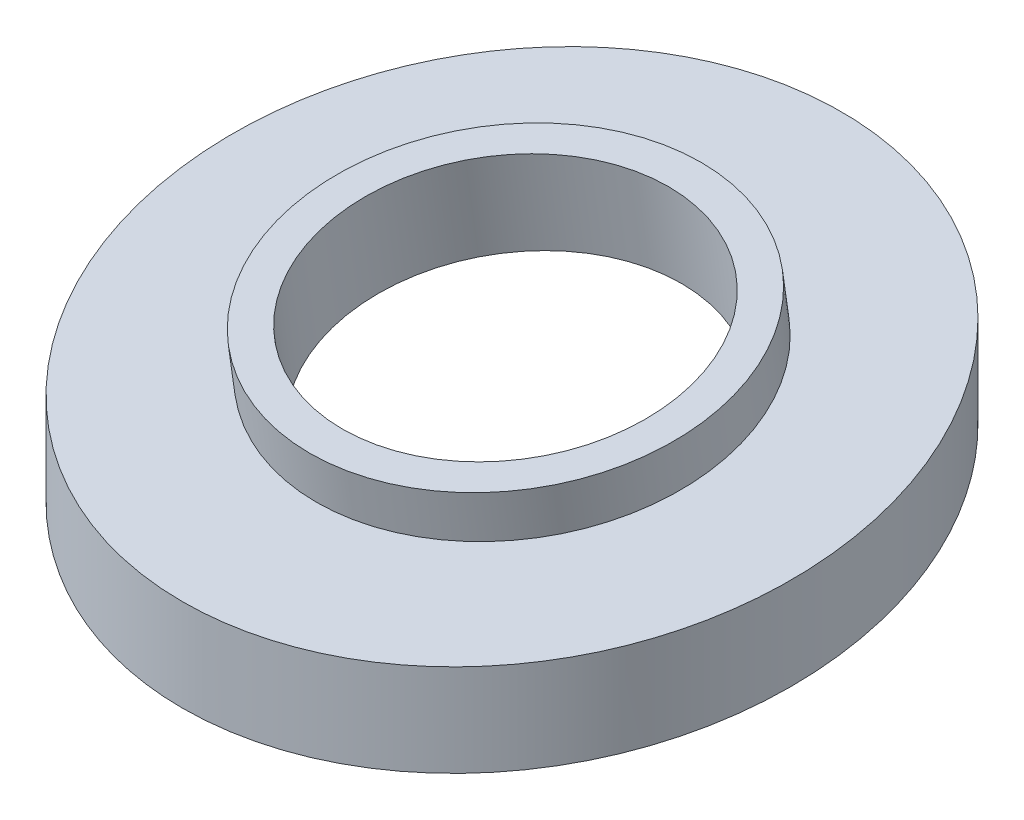
ISO-10303-21;
HEADER;
FILE_DESCRIPTION(('STEP AP214'),'2;1');
FILE_NAME('part.step','',(''),(''),'','','');
FILE_SCHEMA(('AUTOMOTIVE_DESIGN { 1 0 10303 214 1 1 1 1 }'));
ENDSEC;
DATA;
#1=APPLICATION_CONTEXT('core data for automotive mechanical design processes');
#2=APPLICATION_PROTOCOL_DEFINITION('international standard','automotive_design',2000,#1);
#3=PRODUCT_CONTEXT('',#1,'mechanical');
#4=PRODUCT('Part','Part','',(#3));
#5=PRODUCT_RELATED_PRODUCT_CATEGORY('part','',(#4));
#6=PRODUCT_DEFINITION_FORMATION('','',#4);
#7=PRODUCT_DEFINITION_CONTEXT('part definition',#1,'design');
#8=PRODUCT_DEFINITION('design','',#6,#7);
#9=PRODUCT_DEFINITION_SHAPE('','',#8);
#10=(LENGTH_UNIT() NAMED_UNIT(*) SI_UNIT(.MILLI.,.METRE.));
#11=(NAMED_UNIT(*) PLANE_ANGLE_UNIT() SI_UNIT($,.RADIAN.));
#12=(NAMED_UNIT(*) SI_UNIT($,.STERADIAN.) SOLID_ANGLE_UNIT());
#13=UNCERTAINTY_MEASURE_WITH_UNIT(LENGTH_MEASURE(1.E-05),#10,'distance_accuracy_value','');
#14=(GEOMETRIC_REPRESENTATION_CONTEXT(3) GLOBAL_UNCERTAINTY_ASSIGNED_CONTEXT((#13)) GLOBAL_UNIT_ASSIGNED_CONTEXT((#10,
#11,#12)) REPRESENTATION_CONTEXT('',''));
#15=CARTESIAN_POINT('',(0.,0.,0.));
#16=DIRECTION('',(0.,0.,1.));
#17=DIRECTION('',(1.,0.,0.));
#18=AXIS2_PLACEMENT_3D('',#15,#16,#17);
#19=CARTESIAN_POINT('',(0.,30.,0.));
#20=DIRECTION('',(0.,-1.,0.));
#21=DIRECTION('',(0.,0.,-1.));
#22=AXIS2_PLACEMENT_3D('',#19,#20,#21);
#23=CYLINDRICAL_SURFACE('',#22,25.);
#24=CARTESIAN_POINT('',(0.,10.5944492525609,0.));
#25=DIRECTION('',(0.,-0.989821487042019,-0.142314524170676));
#26=DIRECTION('',(0.,-0.142314524170676,0.989821487042019));
#27=AXIS2_PLACEMENT_3D('',#24,#25,#26);
#28=ELLIPSE('',#27,25.2570795110843,25.);
#29=CARTESIAN_POINT('',(0.,7.,25.));
#30=VERTEX_POINT('',#29);
#31=EDGE_CURVE('E43',#30,#30,#28,.T.);
#32=ORIENTED_EDGE('',*,*,#31,.T.);
#33=EDGE_LOOP('',(#32));
#34=FACE_BOUND('',#33,.T.);
#35=CARTESIAN_POINT('',(0.,3.5944492525609,0.));
#36=DIRECTION('',(0.,0.989821487042019,0.142314524170676));
#37=DIRECTION('',(0.,-0.142314524170676,0.989821487042019));
#38=AXIS2_PLACEMENT_3D('',#35,#36,#37);
#39=ELLIPSE('',#38,25.2570795110843,25.);
#40=CARTESIAN_POINT('',(0.,0.,25.));
#41=VERTEX_POINT('',#40);
#42=EDGE_CURVE('E48',#41,#41,#39,.T.);
#43=ORIENTED_EDGE('',*,*,#42,.T.);
#44=EDGE_LOOP('',(#43));
#45=FACE_BOUND('',#44,.T.);
#46=ADVANCED_FACE('F36',(#34,#45),#23,.T.);
#47=CARTESIAN_POINT('',(-31.5,7.,25.));
#48=DIRECTION('',(0.,-0.989821487042019,-0.142314524170676));
#49=DIRECTION('',(0.,0.142314524170676,-0.989821487042019));
#50=AXIS2_PLACEMENT_3D('',#47,#48,#49);
#51=PLANE('',#50);
#52=CARTESIAN_POINT('',(0.,10.5944492525609,0.));
#53=DIRECTION('',(0.,0.989821487042019,0.142314524170676));
#54=DIRECTION('',(0.,-0.142314524170676,0.989821487042019));
#55=AXIS2_PLACEMENT_3D('',#52,#53,#54);
#56=CIRCLE('',#55,15.);
#57=CARTESIAN_POINT('',(0.,8.45973139000076,14.8473223056303));
#58=VERTEX_POINT('',#57);
#59=EDGE_CURVE('E10',#58,#58,#56,.T.);
#60=ORIENTED_EDGE('',*,*,#59,.F.);
#61=EDGE_LOOP('',(#60));
#62=FACE_BOUND('',#61,.T.);
#63=ORIENTED_EDGE('',*,*,#31,.F.);
#64=EDGE_LOOP('',(#63));
#65=FACE_BOUND('',#64,.T.);
#66=ADVANCED_FACE('F89',(#62,#65),#51,.F.);
#67=CARTESIAN_POINT('',(-31.5,0.,25.));
#68=DIRECTION('',(0.,0.989821487042019,0.142314524170676));
#69=DIRECTION('',(0.,-0.142314524170676,0.989821487042019));
#70=AXIS2_PLACEMENT_3D('',#67,#68,#69);
#71=PLANE('',#70);
#72=CARTESIAN_POINT('',(0.,3.73622321909037,-0.986061817596071));
#73=DIRECTION('',(0.,-0.989821487042019,-0.142314524170676));
#74=DIRECTION('',(0.,0.142314524170676,-0.989821487042019));
#75=AXIS2_PLACEMENT_3D('',#72,#73,#74);
#76=CIRCLE('',#75,21.);
#77=CARTESIAN_POINT('',(0.,6.72482822667457,-21.7723130454785));
#78=VERTEX_POINT('',#77);
#79=EDGE_CURVE('E61',#78,#78,#76,.T.);
#80=ORIENTED_EDGE('',*,*,#79,.F.);
#81=EDGE_LOOP('',(#80));
#82=FACE_BOUND('',#81,.T.);
#83=ORIENTED_EDGE('',*,*,#42,.F.);
#84=EDGE_LOOP('',(#83));
#85=FACE_BOUND('',#84,.T.);
#86=ADVANCED_FACE('F94',(#82,#85),#71,.F.);
#87=CARTESIAN_POINT('',(0.,14.058824457208,0.498100834597366));
#88=DIRECTION('',(0.,-0.989821487042019,-0.142314524170676));
#89=DIRECTION('',(0.,0.142314524170676,-0.989821487042019));
#90=AXIS2_PLACEMENT_3D('',#87,#88,#89);
#91=CYLINDRICAL_SURFACE('',#90,15.);
#92=CARTESIAN_POINT('',(0.,14.058824457208,0.498100834597366));
#93=DIRECTION('',(0.,0.989821487042019,0.142314524170676));
#94=DIRECTION('',(0.,-0.142314524170676,0.989821487042019));
#95=AXIS2_PLACEMENT_3D('',#92,#93,#94);
#96=CIRCLE('',#95,15.);
#97=CARTESIAN_POINT('',(0.,11.9241065946478,15.3454231402277));
#98=VERTEX_POINT('',#97);
#99=EDGE_CURVE('E51',#98,#98,#96,.T.);
#100=ORIENTED_EDGE('',*,*,#99,.F.);
#101=EDGE_LOOP('',(#100));
#102=FACE_BOUND('',#101,.T.);
#103=ORIENTED_EDGE('',*,*,#59,.T.);
#104=EDGE_LOOP('',(#103));
#105=FACE_BOUND('',#104,.T.);
#106=ADVANCED_FACE('F101',(#102,#105),#91,.T.);
#107=CARTESIAN_POINT('',(0.,14.058824457208,0.498100834597366));
#108=DIRECTION('',(0.,0.989821487042019,0.142314524170676));
#109=DIRECTION('',(0.,-0.142314524170676,0.989821487042019));
#110=AXIS2_PLACEMENT_3D('',#107,#108,#109);
#111=PLANE('',#110);
#112=CARTESIAN_POINT('',(0.,14.058824457208,0.498100834597366));
#113=DIRECTION('',(0.,0.989821487042019,0.142314524170676));
#114=DIRECTION('',(0.,-0.142314524170676,0.989821487042019));
#115=AXIS2_PLACEMENT_3D('',#112,#113,#114);
#116=CIRCLE('',#115,12.5);
#117=CARTESIAN_POINT('',(0.,12.2798929050745,12.8708694226226));
#118=VERTEX_POINT('',#117);
#119=EDGE_CURVE('E67',#118,#118,#116,.T.);
#120=ORIENTED_EDGE('',*,*,#119,.F.);
#121=EDGE_LOOP('',(#120));
#122=FACE_BOUND('',#121,.T.);
#123=ORIENTED_EDGE('',*,*,#99,.T.);
#124=EDGE_LOOP('',(#123));
#125=FACE_BOUND('',#124,.T.);
#126=ADVANCED_FACE('F85',(#122,#125),#111,.T.);
#127=CARTESIAN_POINT('',(0.,7.20059842373744,-0.487960982998706));
#128=DIRECTION('',(0.,-0.989821487042019,-0.142314524170676));
#129=DIRECTION('',(0.,0.142314524170676,-0.989821487042019));
#130=AXIS2_PLACEMENT_3D('',#127,#128,#129);
#131=CYLINDRICAL_SURFACE('',#130,21.);
#132=CARTESIAN_POINT('',(0.,7.20059842373744,-0.487960982998706));
#133=DIRECTION('',(0.,-0.989821487042019,-0.142314524170676));
#134=DIRECTION('',(0.,0.142314524170676,-0.989821487042019));
#135=AXIS2_PLACEMENT_3D('',#132,#133,#134);
#136=CIRCLE('',#135,21.);
#137=CARTESIAN_POINT('',(0.,10.1892034313216,-21.2742122108811));
#138=VERTEX_POINT('',#137);
#139=EDGE_CURVE('E57',#138,#138,#136,.T.);
#140=ORIENTED_EDGE('',*,*,#139,.F.);
#141=EDGE_LOOP('',(#140));
#142=FACE_BOUND('',#141,.T.);
#143=ORIENTED_EDGE('',*,*,#79,.T.);
#144=EDGE_LOOP('',(#143));
#145=FACE_BOUND('',#144,.T.);
#146=ADVANCED_FACE('F78',(#142,#145),#131,.F.);
#147=CARTESIAN_POINT('',(0.,7.20059842373744,-0.487960982998706));
#148=DIRECTION('',(0.,-0.989821487042019,-0.142314524170676));
#149=DIRECTION('',(0.,0.142314524170676,-0.989821487042019));
#150=AXIS2_PLACEMENT_3D('',#147,#148,#149);
#151=PLANE('',#150);
#152=CARTESIAN_POINT('',(0.,7.20059842373744,-0.487960982998705));
#153=DIRECTION('',(0.,-0.989821487042019,-0.142314524170676));
#154=DIRECTION('',(0.,0.142314524170676,-0.989821487042019));
#155=AXIS2_PLACEMENT_3D('',#152,#153,#154);
#156=CIRCLE('',#155,12.5);
#157=CARTESIAN_POINT('',(0.,8.97952997587089,-12.8607295710239));
#158=VERTEX_POINT('',#157);
#159=EDGE_CURVE('E39',#158,#158,#156,.T.);
#160=ORIENTED_EDGE('',*,*,#159,.F.);
#161=EDGE_LOOP('',(#160));
#162=FACE_BOUND('',#161,.T.);
#163=ORIENTED_EDGE('',*,*,#139,.T.);
#164=EDGE_LOOP('',(#163));
#165=FACE_BOUND('',#164,.T.);
#166=ADVANCED_FACE('F76',(#162,#165),#151,.T.);
#167=CARTESIAN_POINT('',(0.,-9.20198048827949,-2.84629048341352));
#168=DIRECTION('',(0.,0.989821487042019,0.142314524170676));
#169=DIRECTION('',(0.,-0.142314524170676,0.989821487042019));
#170=AXIS2_PLACEMENT_3D('',#167,#168,#169);
#171=CYLINDRICAL_SURFACE('',#170,12.5);
#172=ORIENTED_EDGE('',*,*,#159,.T.);
#173=EDGE_LOOP('',(#172));
#174=FACE_BOUND('',#173,.T.);
#175=ORIENTED_EDGE('',*,*,#119,.T.);
#176=EDGE_LOOP('',(#175));
#177=FACE_BOUND('',#176,.T.);
#178=ADVANCED_FACE('F74',(#174,#177),#171,.F.);
#179=CLOSED_SHELL('',(#46,#66,#86,#106,#126,#146,#166,#178));
#180=MANIFOLD_SOLID_BREP('B2',#179);
#181=ADVANCED_BREP_SHAPE_REPRESENTATION('',(#18,#180),#14);
#182=SHAPE_DEFINITION_REPRESENTATION(#9,#181);
ENDSEC;
END-ISO-10303-21;
